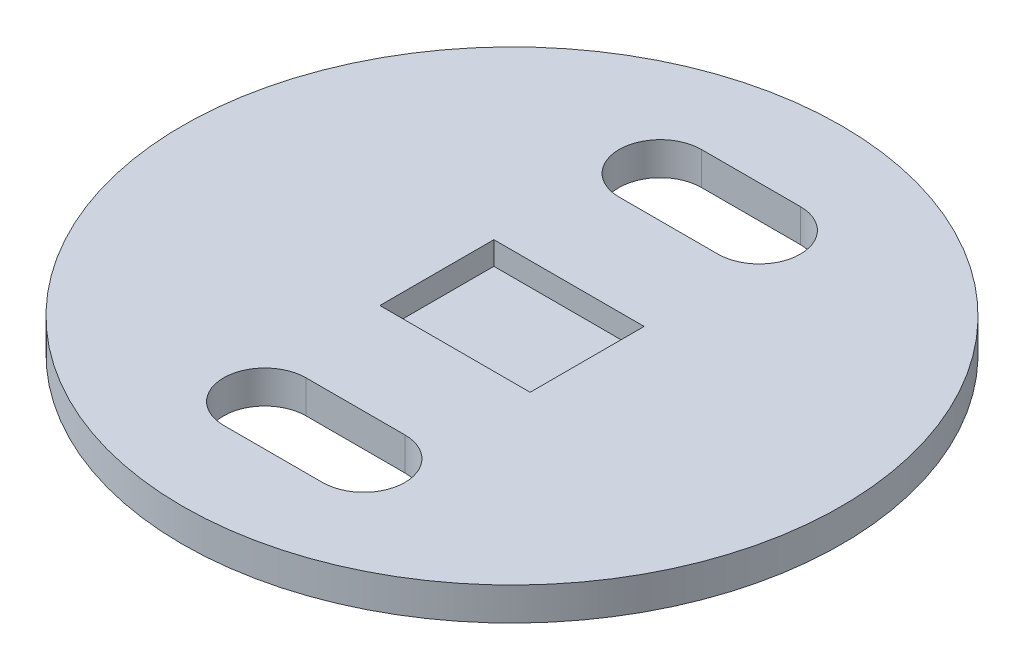
ISO-10303-21;
HEADER;
FILE_DESCRIPTION(('STEP AP214'),'2;1');
FILE_NAME('part.step','',(''),(''),'','','');
FILE_SCHEMA(('AUTOMOTIVE_DESIGN { 1 0 10303 214 1 1 1 1 }'));
ENDSEC;
DATA;
#1=APPLICATION_CONTEXT('core data for automotive mechanical design processes');
#2=APPLICATION_PROTOCOL_DEFINITION('international standard','automotive_design',2000,#1);
#3=PRODUCT_CONTEXT('',#1,'mechanical');
#4=PRODUCT('Part','Part','',(#3));
#5=PRODUCT_RELATED_PRODUCT_CATEGORY('part','',(#4));
#6=PRODUCT_DEFINITION_FORMATION('','',#4);
#7=PRODUCT_DEFINITION_CONTEXT('part definition',#1,'design');
#8=PRODUCT_DEFINITION('design','',#6,#7);
#9=PRODUCT_DEFINITION_SHAPE('','',#8);
#10=(LENGTH_UNIT() NAMED_UNIT(*) SI_UNIT(.MILLI.,.METRE.));
#11=(NAMED_UNIT(*) PLANE_ANGLE_UNIT() SI_UNIT($,.RADIAN.));
#12=(NAMED_UNIT(*) SI_UNIT($,.STERADIAN.) SOLID_ANGLE_UNIT());
#13=UNCERTAINTY_MEASURE_WITH_UNIT(LENGTH_MEASURE(1.E-05),#10,'distance_accuracy_value','');
#14=(GEOMETRIC_REPRESENTATION_CONTEXT(3) GLOBAL_UNCERTAINTY_ASSIGNED_CONTEXT((#13)) GLOBAL_UNIT_ASSIGNED_CONTEXT((#10,
#11,#12)) REPRESENTATION_CONTEXT('',''));
#15=CARTESIAN_POINT('',(0.,0.,0.));
#16=DIRECTION('',(0.,0.,1.));
#17=DIRECTION('',(1.,0.,0.));
#18=AXIS2_PLACEMENT_3D('',#15,#16,#17);
#19=CARTESIAN_POINT('',(0.,10.,0.));
#20=DIRECTION('',(0.,1.,0.));
#21=DIRECTION('',(0.,0.,1.));
#22=AXIS2_PLACEMENT_3D('',#19,#20,#21);
#23=PLANE('',#22);
#24=DIRECTION('',(0.,0.,-1.));
#25=VECTOR('',#24,1.);
#26=CARTESIAN_POINT('',(22.8,10.,0.));
#27=LINE('',#26,#25);
#28=CARTESIAN_POINT('',(22.8,10.,17.3));
#29=VERTEX_POINT('',#28);
#30=CARTESIAN_POINT('',(22.8,10.,-17.3));
#31=VERTEX_POINT('',#30);
#32=EDGE_CURVE('E48',#29,#31,#27,.T.);
#33=ORIENTED_EDGE('',*,*,#32,.F.);
#34=DIRECTION('',(1.,0.,0.));
#35=VECTOR('',#34,1.);
#36=CARTESIAN_POINT('',(0.,10.,17.3));
#37=LINE('',#36,#35);
#38=CARTESIAN_POINT('',(-22.8,10.,17.3));
#39=VERTEX_POINT('',#38);
#40=EDGE_CURVE('E144',#39,#29,#37,.T.);
#41=ORIENTED_EDGE('',*,*,#40,.F.);
#42=DIRECTION('',(0.,0.,1.));
#43=VECTOR('',#42,1.);
#44=CARTESIAN_POINT('',(-22.8,10.,0.));
#45=LINE('',#44,#43);
#46=CARTESIAN_POINT('',(-22.8,10.,-17.3));
#47=VERTEX_POINT('',#46);
#48=EDGE_CURVE('E147',#47,#39,#45,.T.);
#49=ORIENTED_EDGE('',*,*,#48,.F.);
#50=DIRECTION('',(-1.,0.,0.));
#51=VECTOR('',#50,1.);
#52=CARTESIAN_POINT('',(0.,10.,-17.3));
#53=LINE('',#52,#51);
#54=EDGE_CURVE('E153',#31,#47,#53,.T.);
#55=ORIENTED_EDGE('',*,*,#54,.F.);
#56=EDGE_LOOP('',(#33,#41,#49,#55));
#57=FACE_BOUND('',#56,.T.);
#58=CARTESIAN_POINT('',(-15.,10.,60.));
#59=DIRECTION('',(0.,1.,0.));
#60=DIRECTION('',(0.,0.,1.));
#61=AXIS2_PLACEMENT_3D('',#58,#59,#60);
#62=CIRCLE('',#61,12.5);
#63=CARTESIAN_POINT('',(-15.,10.,47.5));
#64=VERTEX_POINT('',#63);
#65=CARTESIAN_POINT('',(-15.,10.,72.5));
#66=VERTEX_POINT('',#65);
#67=EDGE_CURVE('E184',#64,#66,#62,.T.);
#68=ORIENTED_EDGE('',*,*,#67,.F.);
#69=DIRECTION('',(-1.,0.,0.));
#70=VECTOR('',#69,1.);
#71=CARTESIAN_POINT('',(-15.,10.,47.5));
#72=LINE('',#71,#70);
#73=CARTESIAN_POINT('',(15.,10.,47.5));
#74=VERTEX_POINT('',#73);
#75=EDGE_CURVE('E194',#74,#64,#72,.T.);
#76=ORIENTED_EDGE('',*,*,#75,.F.);
#77=CARTESIAN_POINT('',(15.,10.,60.));
#78=DIRECTION('',(0.,1.,0.));
#79=DIRECTION('',(0.,0.,1.));
#80=AXIS2_PLACEMENT_3D('',#77,#78,#79);
#81=CIRCLE('',#80,12.5);
#82=CARTESIAN_POINT('',(15.,10.,72.5));
#83=VERTEX_POINT('',#82);
#84=EDGE_CURVE('E208',#83,#74,#81,.T.);
#85=ORIENTED_EDGE('',*,*,#84,.F.);
#86=DIRECTION('',(1.,0.,0.));
#87=VECTOR('',#86,1.);
#88=CARTESIAN_POINT('',(-15.,10.,72.5));
#89=LINE('',#88,#87);
#90=EDGE_CURVE('E205',#66,#83,#89,.T.);
#91=ORIENTED_EDGE('',*,*,#90,.F.);
#92=EDGE_LOOP('',(#68,#76,#85,#91));
#93=FACE_BOUND('',#92,.T.);
#94=CARTESIAN_POINT('',(0.,10.,0.));
#95=DIRECTION('',(0.,1.,0.));
#96=DIRECTION('',(0.,0.,1.));
#97=AXIS2_PLACEMENT_3D('',#94,#95,#96);
#98=CIRCLE('',#97,100.);
#99=CARTESIAN_POINT('',(0.,10.,100.));
#100=VERTEX_POINT('',#99);
#101=EDGE_CURVE('E11',#100,#100,#98,.T.);
#102=ORIENTED_EDGE('',*,*,#101,.T.);
#103=EDGE_LOOP('',(#102));
#104=FACE_BOUND('',#103,.T.);
#105=DIRECTION('',(-1.,0.,0.));
#106=VECTOR('',#105,1.);
#107=CARTESIAN_POINT('',(-15.,10.,-47.5));
#108=LINE('',#107,#106);
#109=CARTESIAN_POINT('',(15.,10.,-47.5));
#110=VERTEX_POINT('',#109);
#111=CARTESIAN_POINT('',(-15.,10.,-47.5));
#112=VERTEX_POINT('',#111);
#113=EDGE_CURVE('E174',#110,#112,#108,.T.);
#114=ORIENTED_EDGE('',*,*,#113,.T.);
#115=CARTESIAN_POINT('',(-15.,10.,-60.));
#116=DIRECTION('',(0.,-1.,0.));
#117=DIRECTION('',(0.,0.,-1.));
#118=AXIS2_PLACEMENT_3D('',#115,#116,#117);
#119=CIRCLE('',#118,12.5);
#120=CARTESIAN_POINT('',(-15.,10.,-72.5));
#121=VERTEX_POINT('',#120);
#122=EDGE_CURVE('E56',#112,#121,#119,.T.);
#123=ORIENTED_EDGE('',*,*,#122,.T.);
#124=DIRECTION('',(1.,0.,0.));
#125=VECTOR('',#124,1.);
#126=CARTESIAN_POINT('',(-15.,10.,-72.5));
#127=LINE('',#126,#125);
#128=CARTESIAN_POINT('',(15.,10.,-72.5));
#129=VERTEX_POINT('',#128);
#130=EDGE_CURVE('E165',#121,#129,#127,.T.);
#131=ORIENTED_EDGE('',*,*,#130,.T.);
#132=CARTESIAN_POINT('',(15.,10.,-60.));
#133=DIRECTION('',(0.,-1.,0.));
#134=DIRECTION('',(0.,0.,-1.));
#135=AXIS2_PLACEMENT_3D('',#132,#133,#134);
#136=CIRCLE('',#135,12.5);
#137=EDGE_CURVE('E177',#129,#110,#136,.T.);
#138=ORIENTED_EDGE('',*,*,#137,.T.);
#139=EDGE_LOOP('',(#114,#123,#131,#138));
#140=FACE_BOUND('',#139,.T.);
#141=ADVANCED_FACE('F33',(#57,#93,#104,#140),#23,.T.);
#142=CARTESIAN_POINT('',(0.,0.,0.));
#143=DIRECTION('',(0.,1.,0.));
#144=DIRECTION('',(0.,0.,1.));
#145=AXIS2_PLACEMENT_3D('',#142,#143,#144);
#146=PLANE('',#145);
#147=CARTESIAN_POINT('',(0.,0.,0.));
#148=DIRECTION('',(0.,1.,0.));
#149=DIRECTION('',(0.,0.,1.));
#150=AXIS2_PLACEMENT_3D('',#147,#148,#149);
#151=CIRCLE('',#150,100.);
#152=CARTESIAN_POINT('',(0.,0.,100.));
#153=VERTEX_POINT('',#152);
#154=EDGE_CURVE('E37',#153,#153,#151,.T.);
#155=ORIENTED_EDGE('',*,*,#154,.F.);
#156=EDGE_LOOP('',(#155));
#157=FACE_BOUND('',#156,.T.);
#158=DIRECTION('',(-1.,0.,0.));
#159=VECTOR('',#158,1.);
#160=CARTESIAN_POINT('',(-15.,0.,47.5));
#161=LINE('',#160,#159);
#162=CARTESIAN_POINT('',(15.,0.,47.5));
#163=VERTEX_POINT('',#162);
#164=CARTESIAN_POINT('',(-15.,0.,47.5));
#165=VERTEX_POINT('',#164);
#166=EDGE_CURVE('E200',#163,#165,#161,.T.);
#167=ORIENTED_EDGE('',*,*,#166,.T.);
#168=CARTESIAN_POINT('',(-15.,0.,60.));
#169=DIRECTION('',(0.,1.,0.));
#170=DIRECTION('',(0.,0.,1.));
#171=AXIS2_PLACEMENT_3D('',#168,#169,#170);
#172=CIRCLE('',#171,12.5);
#173=CARTESIAN_POINT('',(-15.,0.,72.5));
#174=VERTEX_POINT('',#173);
#175=EDGE_CURVE('E190',#165,#174,#172,.T.);
#176=ORIENTED_EDGE('',*,*,#175,.T.);
#177=DIRECTION('',(1.,0.,0.));
#178=VECTOR('',#177,1.);
#179=CARTESIAN_POINT('',(-15.,0.,72.5));
#180=LINE('',#179,#178);
#181=CARTESIAN_POINT('',(15.,0.,72.5));
#182=VERTEX_POINT('',#181);
#183=EDGE_CURVE('E193',#174,#182,#180,.T.);
#184=ORIENTED_EDGE('',*,*,#183,.T.);
#185=CARTESIAN_POINT('',(15.,0.,60.));
#186=DIRECTION('',(0.,1.,0.));
#187=DIRECTION('',(0.,0.,1.));
#188=AXIS2_PLACEMENT_3D('',#185,#186,#187);
#189=CIRCLE('',#188,12.5);
#190=EDGE_CURVE('E197',#182,#163,#189,.T.);
#191=ORIENTED_EDGE('',*,*,#190,.T.);
#192=EDGE_LOOP('',(#167,#176,#184,#191));
#193=FACE_BOUND('',#192,.T.);
#194=CARTESIAN_POINT('',(-15.,0.,-60.));
#195=DIRECTION('',(0.,-1.,0.));
#196=DIRECTION('',(0.,0.,-1.));
#197=AXIS2_PLACEMENT_3D('',#194,#195,#196);
#198=CIRCLE('',#197,12.5);
#199=CARTESIAN_POINT('',(-15.,0.,-47.5));
#200=VERTEX_POINT('',#199);
#201=CARTESIAN_POINT('',(-15.,0.,-72.5));
#202=VERTEX_POINT('',#201);
#203=EDGE_CURVE('E162',#200,#202,#198,.T.);
#204=ORIENTED_EDGE('',*,*,#203,.F.);
#205=DIRECTION('',(-1.,0.,0.));
#206=VECTOR('',#205,1.);
#207=CARTESIAN_POINT('',(-15.,0.,-47.5));
#208=LINE('',#207,#206);
#209=CARTESIAN_POINT('',(15.,0.,-47.5));
#210=VERTEX_POINT('',#209);
#211=EDGE_CURVE('E164',#210,#200,#208,.T.);
#212=ORIENTED_EDGE('',*,*,#211,.F.);
#213=CARTESIAN_POINT('',(15.,0.,-60.));
#214=DIRECTION('',(0.,-1.,0.));
#215=DIRECTION('',(0.,0.,-1.));
#216=AXIS2_PLACEMENT_3D('',#213,#214,#215);
#217=CIRCLE('',#216,12.5);
#218=CARTESIAN_POINT('',(15.,0.,-72.5));
#219=VERTEX_POINT('',#218);
#220=EDGE_CURVE('E167',#219,#210,#217,.T.);
#221=ORIENTED_EDGE('',*,*,#220,.F.);
#222=DIRECTION('',(1.,0.,0.));
#223=VECTOR('',#222,1.);
#224=CARTESIAN_POINT('',(-15.,0.,-72.5));
#225=LINE('',#224,#223);
#226=EDGE_CURVE('E170',#202,#219,#225,.T.);
#227=ORIENTED_EDGE('',*,*,#226,.F.);
#228=EDGE_LOOP('',(#204,#212,#221,#227));
#229=FACE_BOUND('',#228,.T.);
#230=ADVANCED_FACE('F236',(#157,#193,#229),#146,.F.);
#231=CARTESIAN_POINT('',(0.,10.,0.));
#232=DIRECTION('',(0.,-1.,0.));
#233=DIRECTION('',(0.,0.,-1.));
#234=AXIS2_PLACEMENT_3D('',#231,#232,#233);
#235=CYLINDRICAL_SURFACE('',#234,100.);
#236=ORIENTED_EDGE('',*,*,#101,.F.);
#237=EDGE_LOOP('',(#236));
#238=FACE_BOUND('',#237,.T.);
#239=ORIENTED_EDGE('',*,*,#154,.T.);
#240=EDGE_LOOP('',(#239));
#241=FACE_BOUND('',#240,.T.);
#242=ADVANCED_FACE('F35',(#238,#241),#235,.T.);
#243=CARTESIAN_POINT('',(-15.,0.,60.));
#244=DIRECTION('',(0.,1.,0.));
#245=DIRECTION('',(0.,0.,1.));
#246=AXIS2_PLACEMENT_3D('',#243,#244,#245);
#247=CYLINDRICAL_SURFACE('',#246,12.5);
#248=ORIENTED_EDGE('',*,*,#67,.T.);
#249=DIRECTION('',(0.,1.,0.));
#250=VECTOR('',#249,1.);
#251=CARTESIAN_POINT('',(-15.,0.,72.5));
#252=LINE('',#251,#250);
#253=EDGE_CURVE('E203',#174,#66,#252,.T.);
#254=ORIENTED_EDGE('',*,*,#253,.F.);
#255=ORIENTED_EDGE('',*,*,#175,.F.);
#256=DIRECTION('',(0.,1.,0.));
#257=VECTOR('',#256,1.);
#258=CARTESIAN_POINT('',(-15.,0.,47.5));
#259=LINE('',#258,#257);
#260=EDGE_CURVE('E213',#165,#64,#259,.T.);
#261=ORIENTED_EDGE('',*,*,#260,.T.);
#262=EDGE_LOOP('',(#248,#254,#255,#261));
#263=FACE_BOUND('',#262,.T.);
#264=ADVANCED_FACE('F238',(#263),#247,.F.);
#265=CARTESIAN_POINT('',(-15.,0.,47.5));
#266=DIRECTION('',(0.,0.,-1.));
#267=DIRECTION('',(-1.,0.,0.));
#268=AXIS2_PLACEMENT_3D('',#265,#266,#267);
#269=PLANE('',#268);
#270=ORIENTED_EDGE('',*,*,#75,.T.);
#271=ORIENTED_EDGE('',*,*,#260,.F.);
#272=ORIENTED_EDGE('',*,*,#166,.F.);
#273=DIRECTION('',(0.,1.,0.));
#274=VECTOR('',#273,1.);
#275=CARTESIAN_POINT('',(15.,0.,47.5));
#276=LINE('',#275,#274);
#277=EDGE_CURVE('E215',#163,#74,#276,.T.);
#278=ORIENTED_EDGE('',*,*,#277,.T.);
#279=EDGE_LOOP('',(#270,#271,#272,#278));
#280=FACE_BOUND('',#279,.T.);
#281=ADVANCED_FACE('F240',(#280),#269,.F.);
#282=CARTESIAN_POINT('',(15.,0.,60.));
#283=DIRECTION('',(0.,1.,0.));
#284=DIRECTION('',(0.,0.,1.));
#285=AXIS2_PLACEMENT_3D('',#282,#283,#284);
#286=CYLINDRICAL_SURFACE('',#285,12.5);
#287=ORIENTED_EDGE('',*,*,#84,.T.);
#288=ORIENTED_EDGE('',*,*,#277,.F.);
#289=ORIENTED_EDGE('',*,*,#190,.F.);
#290=DIRECTION('',(0.,1.,0.));
#291=VECTOR('',#290,1.);
#292=CARTESIAN_POINT('',(15.,0.,72.5));
#293=LINE('',#292,#291);
#294=EDGE_CURVE('E217',#182,#83,#293,.T.);
#295=ORIENTED_EDGE('',*,*,#294,.T.);
#296=EDGE_LOOP('',(#287,#288,#289,#295));
#297=FACE_BOUND('',#296,.T.);
#298=ADVANCED_FACE('F233',(#297),#286,.F.);
#299=CARTESIAN_POINT('',(-15.,0.,72.5));
#300=DIRECTION('',(0.,0.,1.));
#301=DIRECTION('',(1.,0.,0.));
#302=AXIS2_PLACEMENT_3D('',#299,#300,#301);
#303=PLANE('',#302);
#304=ORIENTED_EDGE('',*,*,#90,.T.);
#305=ORIENTED_EDGE('',*,*,#294,.F.);
#306=ORIENTED_EDGE('',*,*,#183,.F.);
#307=ORIENTED_EDGE('',*,*,#253,.T.);
#308=EDGE_LOOP('',(#304,#305,#306,#307));
#309=FACE_BOUND('',#308,.T.);
#310=ADVANCED_FACE('F223',(#309),#303,.F.);
#311=CARTESIAN_POINT('',(-15.,0.,-60.));
#312=DIRECTION('',(0.,1.,0.));
#313=DIRECTION('',(0.,0.,1.));
#314=AXIS2_PLACEMENT_3D('',#311,#312,#313);
#315=CYLINDRICAL_SURFACE('',#314,12.5);
#316=ORIENTED_EDGE('',*,*,#122,.F.);
#317=DIRECTION('',(0.,1.,0.));
#318=VECTOR('',#317,1.);
#319=CARTESIAN_POINT('',(-15.,0.,-47.5));
#320=LINE('',#319,#318);
#321=EDGE_CURVE('E172',#200,#112,#320,.T.);
#322=ORIENTED_EDGE('',*,*,#321,.F.);
#323=ORIENTED_EDGE('',*,*,#203,.T.);
#324=DIRECTION('',(0.,1.,0.));
#325=VECTOR('',#324,1.);
#326=CARTESIAN_POINT('',(-15.,0.,-72.5));
#327=LINE('',#326,#325);
#328=EDGE_CURVE('E182',#202,#121,#327,.T.);
#329=ORIENTED_EDGE('',*,*,#328,.T.);
#330=EDGE_LOOP('',(#316,#322,#323,#329));
#331=FACE_BOUND('',#330,.T.);
#332=ADVANCED_FACE('F261',(#331),#315,.F.);
#333=CARTESIAN_POINT('',(-15.,0.,-72.5));
#334=DIRECTION('',(0.,0.,1.));
#335=DIRECTION('',(1.,0.,0.));
#336=AXIS2_PLACEMENT_3D('',#333,#334,#335);
#337=PLANE('',#336);
#338=ORIENTED_EDGE('',*,*,#130,.F.);
#339=ORIENTED_EDGE('',*,*,#328,.F.);
#340=ORIENTED_EDGE('',*,*,#226,.T.);
#341=DIRECTION('',(0.,1.,0.));
#342=VECTOR('',#341,1.);
#343=CARTESIAN_POINT('',(15.,0.,-72.5));
#344=LINE('',#343,#342);
#345=EDGE_CURVE('E185',#219,#129,#344,.T.);
#346=ORIENTED_EDGE('',*,*,#345,.T.);
#347=EDGE_LOOP('',(#338,#339,#340,#346));
#348=FACE_BOUND('',#347,.T.);
#349=ADVANCED_FACE('F265',(#348),#337,.T.);
#350=CARTESIAN_POINT('',(15.,0.,-60.));
#351=DIRECTION('',(0.,1.,0.));
#352=DIRECTION('',(0.,0.,1.));
#353=AXIS2_PLACEMENT_3D('',#350,#351,#352);
#354=CYLINDRICAL_SURFACE('',#353,12.5);
#355=ORIENTED_EDGE('',*,*,#137,.F.);
#356=ORIENTED_EDGE('',*,*,#345,.F.);
#357=ORIENTED_EDGE('',*,*,#220,.T.);
#358=DIRECTION('',(0.,1.,0.));
#359=VECTOR('',#358,1.);
#360=CARTESIAN_POINT('',(15.,0.,-47.5));
#361=LINE('',#360,#359);
#362=EDGE_CURVE('E187',#210,#110,#361,.T.);
#363=ORIENTED_EDGE('',*,*,#362,.T.);
#364=EDGE_LOOP('',(#355,#356,#357,#363));
#365=FACE_BOUND('',#364,.T.);
#366=ADVANCED_FACE('F269',(#365),#354,.F.);
#367=CARTESIAN_POINT('',(-15.,0.,-47.5));
#368=DIRECTION('',(0.,0.,-1.));
#369=DIRECTION('',(-1.,0.,0.));
#370=AXIS2_PLACEMENT_3D('',#367,#368,#369);
#371=PLANE('',#370);
#372=ORIENTED_EDGE('',*,*,#113,.F.);
#373=ORIENTED_EDGE('',*,*,#362,.F.);
#374=ORIENTED_EDGE('',*,*,#211,.T.);
#375=ORIENTED_EDGE('',*,*,#321,.T.);
#376=EDGE_LOOP('',(#372,#373,#374,#375));
#377=FACE_BOUND('',#376,.T.);
#378=ADVANCED_FACE('F273',(#377),#371,.T.);
#379=CARTESIAN_POINT('',(22.8,3.,0.));
#380=DIRECTION('',(1.,0.,0.));
#381=DIRECTION('',(0.,0.,-1.));
#382=AXIS2_PLACEMENT_3D('',#379,#380,#381);
#383=PLANE('',#382);
#384=ORIENTED_EDGE('',*,*,#32,.T.);
#385=DIRECTION('',(0.,1.,0.));
#386=VECTOR('',#385,1.);
#387=CARTESIAN_POINT('',(22.8,3.,-17.3));
#388=LINE('',#387,#386);
#389=CARTESIAN_POINT('',(22.8,3.,-17.3));
#390=VERTEX_POINT('',#389);
#391=EDGE_CURVE('E122',#390,#31,#388,.T.);
#392=ORIENTED_EDGE('',*,*,#391,.F.);
#393=DIRECTION('',(0.,0.,-1.));
#394=VECTOR('',#393,1.);
#395=CARTESIAN_POINT('',(22.8,3.,0.));
#396=LINE('',#395,#394);
#397=CARTESIAN_POINT('',(22.8,3.,17.3));
#398=VERTEX_POINT('',#397);
#399=EDGE_CURVE('E126',#398,#390,#396,.T.);
#400=ORIENTED_EDGE('',*,*,#399,.F.);
#401=DIRECTION('',(0.,1.,0.));
#402=VECTOR('',#401,1.);
#403=CARTESIAN_POINT('',(22.8,3.,17.3));
#404=LINE('',#403,#402);
#405=EDGE_CURVE('E157',#398,#29,#404,.T.);
#406=ORIENTED_EDGE('',*,*,#405,.T.);
#407=EDGE_LOOP('',(#384,#392,#400,#406));
#408=FACE_BOUND('',#407,.T.);
#409=ADVANCED_FACE('F124',(#408),#383,.F.);
#410=CARTESIAN_POINT('',(0.,3.,17.3));
#411=DIRECTION('',(0.,0.,1.));
#412=DIRECTION('',(1.,0.,0.));
#413=AXIS2_PLACEMENT_3D('',#410,#411,#412);
#414=PLANE('',#413);
#415=ORIENTED_EDGE('',*,*,#40,.T.);
#416=ORIENTED_EDGE('',*,*,#405,.F.);
#417=DIRECTION('',(1.,0.,0.));
#418=VECTOR('',#417,1.);
#419=CARTESIAN_POINT('',(0.,3.,17.3));
#420=LINE('',#419,#418);
#421=CARTESIAN_POINT('',(-22.8,3.,17.3));
#422=VERTEX_POINT('',#421);
#423=EDGE_CURVE('E132',#422,#398,#420,.T.);
#424=ORIENTED_EDGE('',*,*,#423,.F.);
#425=DIRECTION('',(0.,1.,0.));
#426=VECTOR('',#425,1.);
#427=CARTESIAN_POINT('',(-22.8,3.,17.3));
#428=LINE('',#427,#426);
#429=EDGE_CURVE('E159',#422,#39,#428,.T.);
#430=ORIENTED_EDGE('',*,*,#429,.T.);
#431=EDGE_LOOP('',(#415,#416,#424,#430));
#432=FACE_BOUND('',#431,.T.);
#433=ADVANCED_FACE('F282',(#432),#414,.F.);
#434=CARTESIAN_POINT('',(-22.8,3.,0.));
#435=DIRECTION('',(-1.,0.,0.));
#436=DIRECTION('',(0.,0.,1.));
#437=AXIS2_PLACEMENT_3D('',#434,#435,#436);
#438=PLANE('',#437);
#439=ORIENTED_EDGE('',*,*,#48,.T.);
#440=ORIENTED_EDGE('',*,*,#429,.F.);
#441=DIRECTION('',(0.,0.,1.));
#442=VECTOR('',#441,1.);
#443=CARTESIAN_POINT('',(-22.8,3.,0.));
#444=LINE('',#443,#442);
#445=CARTESIAN_POINT('',(-22.8,3.,-17.3));
#446=VERTEX_POINT('',#445);
#447=EDGE_CURVE('E140',#446,#422,#444,.T.);
#448=ORIENTED_EDGE('',*,*,#447,.F.);
#449=DIRECTION('',(0.,1.,0.));
#450=VECTOR('',#449,1.);
#451=CARTESIAN_POINT('',(-22.8,3.,-17.3));
#452=LINE('',#451,#450);
#453=EDGE_CURVE('E131',#446,#47,#452,.T.);
#454=ORIENTED_EDGE('',*,*,#453,.T.);
#455=EDGE_LOOP('',(#439,#440,#448,#454));
#456=FACE_BOUND('',#455,.T.);
#457=ADVANCED_FACE('F285',(#456),#438,.F.);
#458=CARTESIAN_POINT('',(0.,3.,-17.3));
#459=DIRECTION('',(0.,0.,-1.));
#460=DIRECTION('',(-1.,0.,0.));
#461=AXIS2_PLACEMENT_3D('',#458,#459,#460);
#462=PLANE('',#461);
#463=ORIENTED_EDGE('',*,*,#54,.T.);
#464=ORIENTED_EDGE('',*,*,#453,.F.);
#465=DIRECTION('',(-1.,0.,0.));
#466=VECTOR('',#465,1.);
#467=CARTESIAN_POINT('',(0.,3.,-17.3));
#468=LINE('',#467,#466);
#469=EDGE_CURVE('E135',#390,#446,#468,.T.);
#470=ORIENTED_EDGE('',*,*,#469,.F.);
#471=ORIENTED_EDGE('',*,*,#391,.T.);
#472=EDGE_LOOP('',(#463,#464,#470,#471));
#473=FACE_BOUND('',#472,.T.);
#474=ADVANCED_FACE('F136',(#473),#462,.F.);
#475=CARTESIAN_POINT('',(0.,3.,0.));
#476=DIRECTION('',(0.,1.,0.));
#477=DIRECTION('',(0.,0.,1.));
#478=AXIS2_PLACEMENT_3D('',#475,#476,#477);
#479=PLANE('',#478);
#480=ORIENTED_EDGE('',*,*,#399,.T.);
#481=ORIENTED_EDGE('',*,*,#469,.T.);
#482=ORIENTED_EDGE('',*,*,#447,.T.);
#483=ORIENTED_EDGE('',*,*,#423,.T.);
#484=EDGE_LOOP('',(#480,#481,#482,#483));
#485=FACE_BOUND('',#484,.T.);
#486=ADVANCED_FACE('F142',(#485),#479,.T.);
#487=CLOSED_SHELL('',(#141,#230,#242,#264,#281,#298,#310,#332,#349,#366,#378,#409,#433,#457,
#474,#486));
#488=MANIFOLD_SOLID_BREP('B2',#487);
#489=ADVANCED_BREP_SHAPE_REPRESENTATION('',(#18,#488),#14);
#490=SHAPE_DEFINITION_REPRESENTATION(#9,#489);
ENDSEC;
END-ISO-10303-21;
